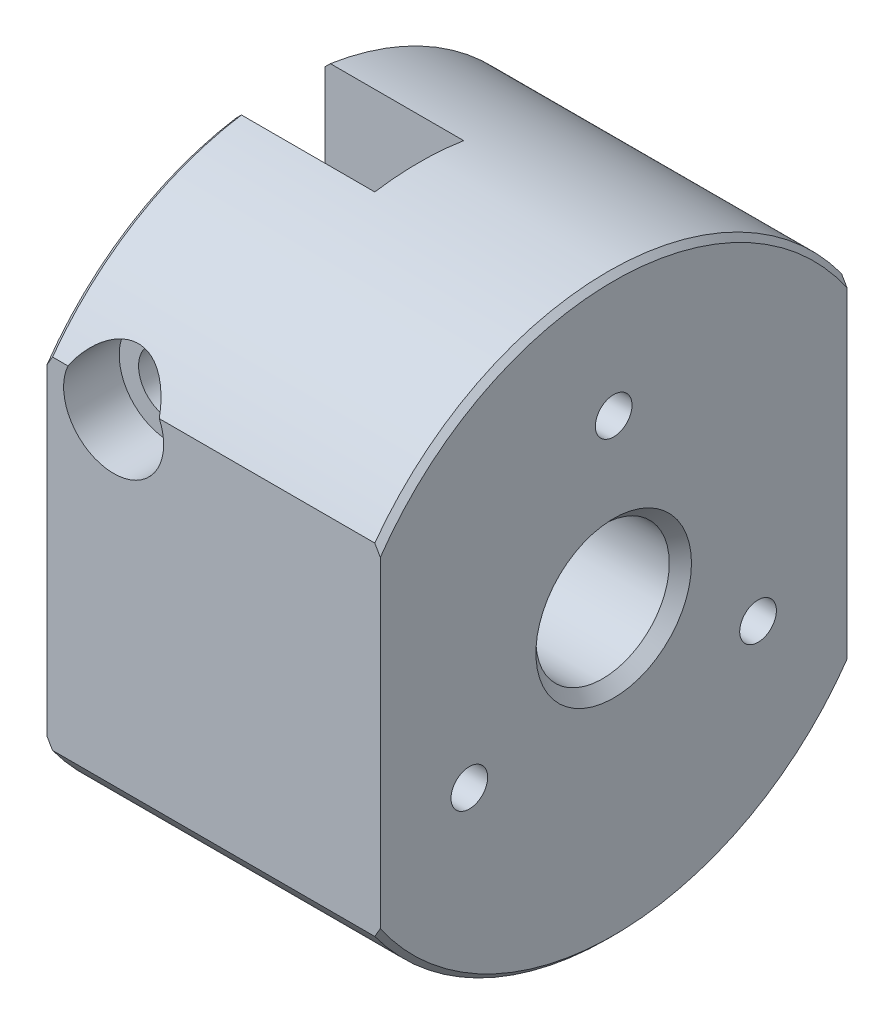
ISO-10303-21;
HEADER;
FILE_DESCRIPTION(('STEP AP214'),'2;1');
FILE_NAME('part.step','',(''),(''),'','','');
FILE_SCHEMA(('AUTOMOTIVE_DESIGN { 1 0 10303 214 1 1 1 1 }'));
ENDSEC;
DATA;
#1=APPLICATION_CONTEXT('core data for automotive mechanical design processes');
#2=APPLICATION_PROTOCOL_DEFINITION('international standard','automotive_design',2000,#1);
#3=PRODUCT_CONTEXT('',#1,'mechanical');
#4=PRODUCT('Part','Part','',(#3));
#5=PRODUCT_RELATED_PRODUCT_CATEGORY('part','',(#4));
#6=PRODUCT_DEFINITION_FORMATION('','',#4);
#7=PRODUCT_DEFINITION_CONTEXT('part definition',#1,'design');
#8=PRODUCT_DEFINITION('design','',#6,#7);
#9=PRODUCT_DEFINITION_SHAPE('','',#8);
#10=(LENGTH_UNIT() NAMED_UNIT(*) SI_UNIT(.MILLI.,.METRE.));
#11=(NAMED_UNIT(*) PLANE_ANGLE_UNIT() SI_UNIT($,.RADIAN.));
#12=(NAMED_UNIT(*) SI_UNIT($,.STERADIAN.) SOLID_ANGLE_UNIT());
#13=UNCERTAINTY_MEASURE_WITH_UNIT(LENGTH_MEASURE(1.E-05),#10,'distance_accuracy_value','');
#14=(GEOMETRIC_REPRESENTATION_CONTEXT(3) GLOBAL_UNCERTAINTY_ASSIGNED_CONTEXT((#13)) GLOBAL_UNIT_ASSIGNED_CONTEXT((#10,
#11,#12)) REPRESENTATION_CONTEXT('',''));
#15=CARTESIAN_POINT('',(0.,0.,0.));
#16=DIRECTION('',(0.,0.,1.));
#17=DIRECTION('',(1.,0.,0.));
#18=AXIS2_PLACEMENT_3D('',#15,#16,#17);
#19=CARTESIAN_POINT('',(-30.,0.,0.));
#20=DIRECTION('',(1.,0.,0.));
#21=DIRECTION('',(0.,0.,-1.));
#22=AXIS2_PLACEMENT_3D('',#19,#20,#21);
#23=CYLINDRICAL_SURFACE('',#22,26.);
#24=DIRECTION('',(1.,0.,0.));
#25=VECTOR('',#24,1.);
#26=CARTESIAN_POINT('',(-30.,-15.3297097167559,-21.));
#27=LINE('',#26,#25);
#28=CARTESIAN_POINT('',(-29.5000000000013,-15.3297097167559,-21.));
#29=VERTEX_POINT('',#28);
#30=CARTESIAN_POINT('',(-0.50000000000127,-15.3297097167559,-21.));
#31=VERTEX_POINT('',#30);
#32=EDGE_CURVE('E237',#29,#31,#27,.T.);
#33=ORIENTED_EDGE('',*,*,#32,.T.);
#34=CARTESIAN_POINT('',(-0.50000000000127,0.,0.));
#35=DIRECTION('',(1.,0.,0.));
#36=DIRECTION('',(0.,0.,-1.));
#37=AXIS2_PLACEMENT_3D('',#34,#35,#36);
#38=CIRCLE('',#37,26.);
#39=CARTESIAN_POINT('',(-0.50000000000127,-15.3297097167559,21.));
#40=VERTEX_POINT('',#39);
#41=EDGE_CURVE('E455',#31,#40,#38,.F.);
#42=ORIENTED_EDGE('',*,*,#41,.T.);
#43=DIRECTION('',(1.,0.,0.));
#44=VECTOR('',#43,1.);
#45=CARTESIAN_POINT('',(-30.,-15.3297097167559,21.));
#46=LINE('',#45,#44);
#47=CARTESIAN_POINT('',(-29.5000000000013,-15.3297097167559,21.));
#48=VERTEX_POINT('',#47);
#49=EDGE_CURVE('E242',#48,#40,#46,.T.);
#50=ORIENTED_EDGE('',*,*,#49,.F.);
#51=CARTESIAN_POINT('',(-29.5000000000013,0.,0.));
#52=DIRECTION('',(1.,0.,0.));
#53=DIRECTION('',(0.,0.,-1.));
#54=AXIS2_PLACEMENT_3D('',#51,#52,#53);
#55=CIRCLE('',#54,26.);
#56=EDGE_CURVE('E449',#48,#29,#55,.T.);
#57=ORIENTED_EDGE('',*,*,#56,.T.);
#58=EDGE_LOOP('',(#33,#42,#50,#57));
#59=FACE_BOUND('',#58,.T.);
#60=ADVANCED_FACE('F35',(#59),#23,.T.);
#61=CARTESIAN_POINT('',(-30.,15.3297097167559,21.));
#62=DIRECTION('',(0.,0.,1.));
#63=DIRECTION('',(1.,0.,0.));
#64=AXIS2_PLACEMENT_3D('',#61,#62,#63);
#65=PLANE('',#64);
#66=DIRECTION('',(0.,-1.,0.));
#67=VECTOR('',#66,1.);
#68=CARTESIAN_POINT('',(0.,15.3297097167559,21.));
#69=LINE('',#68,#67);
#70=CARTESIAN_POINT('',(0.,14.4654761414917,21.));
#71=VERTEX_POINT('',#70);
#72=CARTESIAN_POINT('',(0.,-14.4654761414917,21.));
#73=VERTEX_POINT('',#72);
#74=EDGE_CURVE('E234',#71,#73,#69,.T.);
#75=ORIENTED_EDGE('',*,*,#74,.F.);
#76=CARTESIAN_POINT('',(0.,14.4654761414917,21.));
#77=CARTESIAN_POINT('',(-0.0821285093217325,14.610212151032,21.));
#78=CARTESIAN_POINT('',(-0.164859437828265,14.7545996325799,21.));
#79=CARTESIAN_POINT('',(-0.331526104904609,15.0426774907645,21.));
#80=CARTESIAN_POINT('',(-0.415461843065167,15.186367867638,21.));
#81=CARTESIAN_POINT('',(-0.50000000000127,15.3297097167559,21.));
#82=B_SPLINE_CURVE_WITH_KNOTS('',3,(#76,#77,#78,#79,#80,#81),.UNSPECIFIED.,.F.,.F.,(4,2,4),(0.,
0.499228767434057,0.998457365292191),.UNSPECIFIED.);
#83=CARTESIAN_POINT('',(-0.50000000000127,15.3297097167559,21.));
#84=VERTEX_POINT('',#83);
#85=EDGE_CURVE('E382',#71,#84,#82,.T.);
#86=ORIENTED_EDGE('',*,*,#85,.T.);
#87=DIRECTION('',(1.,0.,0.));
#88=VECTOR('',#87,1.);
#89=CARTESIAN_POINT('',(-30.,15.3297097167559,21.));
#90=LINE('',#89,#88);
#91=CARTESIAN_POINT('',(-19.8887760517811,15.3297097167559,21.));
#92=VERTEX_POINT('',#91);
#93=EDGE_CURVE('E248',#92,#84,#90,.T.);
#94=ORIENTED_EDGE('',*,*,#93,.F.);
#95=CARTESIAN_POINT('',(-24.,13.5,21.));
#96=DIRECTION('',(0.,0.,1.));
#97=DIRECTION('',(1.,0.,0.));
#98=AXIS2_PLACEMENT_3D('',#95,#96,#97);
#99=CIRCLE('',#98,4.49999999999999);
#100=CARTESIAN_POINT('',(-28.1112239482189,15.3297097167559,21.));
#101=VERTEX_POINT('',#100);
#102=EDGE_CURVE('E181',#101,#92,#99,.T.);
#103=ORIENTED_EDGE('',*,*,#102,.F.);
#104=CARTESIAN_POINT('',(-29.5000000000013,15.3297097167559,21.));
#105=VERTEX_POINT('',#104);
#106=EDGE_CURVE('E246',#105,#101,#90,.T.);
#107=ORIENTED_EDGE('',*,*,#106,.F.);
#108=CARTESIAN_POINT('',(-29.5000000000013,15.3297097167559,21.));
#109=CARTESIAN_POINT('',(-29.584538156937,15.1863678676372,21.));
#110=CARTESIAN_POINT('',(-29.6684738950971,15.042677490763,21.));
#111=CARTESIAN_POINT('',(-29.8351405621726,14.7545996325769,21.));
#112=CARTESIAN_POINT('',(-29.9178714906787,14.6102121510282,21.));
#113=CARTESIAN_POINT('',(-30.,14.4654761414872,21.));
#114=B_SPLINE_CURVE_WITH_KNOTS('',3,(#108,#109,#110,#111,#112,#113),.UNSPECIFIED.,.F.,.F.,(4,2,
4),(0.,0.499228597859451,0.998457365294827),.UNSPECIFIED.);
#115=CARTESIAN_POINT('',(-30.,14.4654761414872,21.));
#116=VERTEX_POINT('',#115);
#117=EDGE_CURVE('E362',#105,#116,#114,.T.);
#118=ORIENTED_EDGE('',*,*,#117,.T.);
#119=DIRECTION('',(0.,-1.,0.));
#120=VECTOR('',#119,1.);
#121=CARTESIAN_POINT('',(-30.,15.3297097167559,21.));
#122=LINE('',#121,#120);
#123=CARTESIAN_POINT('',(-30.,-14.4654761414872,21.));
#124=VERTEX_POINT('',#123);
#125=EDGE_CURVE('E233',#116,#124,#122,.T.);
#126=ORIENTED_EDGE('',*,*,#125,.T.);
#127=CARTESIAN_POINT('',(-30.,-14.4654761414872,21.));
#128=CARTESIAN_POINT('',(-29.9178714906787,-14.6102121510282,21.));
#129=CARTESIAN_POINT('',(-29.8351405621726,-14.7545996325768,21.));
#130=CARTESIAN_POINT('',(-29.6684738950971,-15.042677490763,21.));
#131=CARTESIAN_POINT('',(-29.584538156937,-15.1863678676372,21.));
#132=CARTESIAN_POINT('',(-29.5000000000013,-15.3297097167559,21.));
#133=B_SPLINE_CURVE_WITH_KNOTS('',3,(#127,#128,#129,#130,#131,#132),.UNSPECIFIED.,.F.,.F.,(4,2,
4),(0.,0.499228767435384,0.998457365294843),.UNSPECIFIED.);
#134=EDGE_CURVE('E356',#124,#48,#133,.T.);
#135=ORIENTED_EDGE('',*,*,#134,.T.);
#136=ORIENTED_EDGE('',*,*,#49,.T.);
#137=CARTESIAN_POINT('',(-0.50000000000127,-15.3297097167559,21.));
#138=CARTESIAN_POINT('',(-0.415461843065167,-15.186367867638,21.));
#139=CARTESIAN_POINT('',(-0.331526104904609,-15.0426774907645,21.));
#140=CARTESIAN_POINT('',(-0.164859437828265,-14.7545996325799,21.));
#141=CARTESIAN_POINT('',(-0.0821285093217327,-14.610212151032,21.));
#142=CARTESIAN_POINT('',(0.,-14.4654761414917,21.));
#143=B_SPLINE_CURVE_WITH_KNOTS('',3,(#137,#138,#139,#140,#141,#142),.UNSPECIFIED.,.F.,.F.,(4,2,
4),(0.,0.499228597858133,0.99845736529219),.UNSPECIFIED.);
#144=EDGE_CURVE('E378',#40,#73,#143,.T.);
#145=ORIENTED_EDGE('',*,*,#144,.T.);
#146=EDGE_LOOP('',(#75,#86,#94,#103,#107,#118,#126,#135,#136,#145));
#147=FACE_BOUND('',#146,.T.);
#148=ADVANCED_FACE('F369',(#147),#65,.T.);
#149=CARTESIAN_POINT('',(-30.,0.,0.));
#150=DIRECTION('',(1.,0.,0.));
#151=DIRECTION('',(0.,0.,-1.));
#152=AXIS2_PLACEMENT_3D('',#149,#150,#151);
#153=CYLINDRICAL_SURFACE('',#152,26.);
#154=DIRECTION('',(1.,0.,0.));
#155=VECTOR('',#154,1.);
#156=CARTESIAN_POINT('',(-30.,15.3297097167559,-21.));
#157=LINE('',#156,#155);
#158=CARTESIAN_POINT('',(-29.5000000000013,15.3297097167559,-21.));
#159=VERTEX_POINT('',#158);
#160=CARTESIAN_POINT('',(-0.50000000000127,15.3297097167559,-21.));
#161=VERTEX_POINT('',#160);
#162=EDGE_CURVE('E249',#159,#161,#157,.T.);
#163=ORIENTED_EDGE('',*,*,#162,.F.);
#164=CARTESIAN_POINT('',(-29.5000000000013,0.,0.));
#165=DIRECTION('',(1.,0.,0.));
#166=DIRECTION('',(0.,0.,-1.));
#167=AXIS2_PLACEMENT_3D('',#164,#165,#166);
#168=CIRCLE('',#167,26.);
#169=CARTESIAN_POINT('',(-29.5000000000013,25.6904651573303,-4.));
#170=VERTEX_POINT('',#169);
#171=EDGE_CURVE('E432',#159,#170,#168,.T.);
#172=ORIENTED_EDGE('',*,*,#171,.T.);
#173=DIRECTION('',(-1.,0.,0.));
#174=VECTOR('',#173,1.);
#175=CARTESIAN_POINT('',(-17.5,25.6904651573303,-4.));
#176=LINE('',#175,#174);
#177=CARTESIAN_POINT('',(-17.5,25.6904651573303,-4.));
#178=VERTEX_POINT('',#177);
#179=EDGE_CURVE('E215',#178,#170,#176,.T.);
#180=ORIENTED_EDGE('',*,*,#179,.F.);
#181=CARTESIAN_POINT('',(-17.5,0.,0.));
#182=DIRECTION('',(-1.,0.,0.));
#183=DIRECTION('',(0.,0.,1.));
#184=AXIS2_PLACEMENT_3D('',#181,#182,#183);
#185=CIRCLE('',#184,26.);
#186=CARTESIAN_POINT('',(-17.5,25.6904651573303,4.));
#187=VERTEX_POINT('',#186);
#188=EDGE_CURVE('E202',#187,#178,#185,.T.);
#189=ORIENTED_EDGE('',*,*,#188,.F.);
#190=DIRECTION('',(-1.,0.,0.));
#191=VECTOR('',#190,1.);
#192=CARTESIAN_POINT('',(-17.5,25.6904651573303,4.));
#193=LINE('',#192,#191);
#194=CARTESIAN_POINT('',(-29.5000000000013,25.6904651573303,4.));
#195=VERTEX_POINT('',#194);
#196=EDGE_CURVE('E219',#187,#195,#193,.T.);
#197=ORIENTED_EDGE('',*,*,#196,.T.);
#198=CARTESIAN_POINT('',(-29.5000000000013,0.,0.));
#199=DIRECTION('',(1.,0.,0.));
#200=DIRECTION('',(0.,0.,-1.));
#201=AXIS2_PLACEMENT_3D('',#198,#199,#200);
#202=CIRCLE('',#201,26.);
#203=EDGE_CURVE('E261',#195,#105,#202,.T.);
#204=ORIENTED_EDGE('',*,*,#203,.T.);
#205=ORIENTED_EDGE('',*,*,#106,.T.);
#206=CARTESIAN_POINT('',(-19.8887760517811,15.3297097167559,21.));
#207=CARTESIAN_POINT('',(-19.9532813286592,15.4745746570309,20.8942740964762));
#208=CARTESIAN_POINT('',(-20.0254261694329,15.6161314749052,20.7886188610443));
#209=CARTESIAN_POINT('',(-20.1849617027227,15.8918551304662,20.578599794341));
#210=CARTESIAN_POINT('',(-20.2723785353369,16.0260087699643,20.4742385112818));
#211=CARTESIAN_POINT('',(-20.4631443033817,16.2869352073428,20.2673085294681));
#212=CARTESIAN_POINT('',(-20.5666430076095,16.4136213559169,20.1647679713873));
#213=CARTESIAN_POINT('',(-20.788786549744,16.6567726713648,19.9643865039791));
#214=CARTESIAN_POINT('',(-20.9074182263076,16.7732465731746,19.866541611344));
#215=CARTESIAN_POINT('',(-21.20028289446,17.0299646672447,19.6473168740909));
#216=CARTESIAN_POINT('',(-21.3801837239416,17.1659468770962,19.5283801754201));
#217=CARTESIAN_POINT('',(-21.7655644541301,17.4127232171785,19.3086585201997));
#218=CARTESIAN_POINT('',(-21.9709420209252,17.5236133688716,19.20780468351));
#219=CARTESIAN_POINT('',(-22.3628906543782,17.6959646865732,19.0489846963123));
#220=CARTESIAN_POINT('',(-22.5451726997834,17.7628619706411,18.986482536539));
#221=CARTESIAN_POINT('',(-22.8279454371263,17.8457999466622,18.908433448145));
#222=CARTESIAN_POINT('',(-22.9237973253493,17.8705503601745,18.8850288739609));
#223=CARTESIAN_POINT('',(-23.1180785820688,17.9138534358533,18.8439579261665));
#224=CARTESIAN_POINT('',(-23.2165068031169,17.9324088081729,18.8262890434496));
#225=CARTESIAN_POINT('',(-23.4159502605761,17.9630859393738,18.7970209766793));
#226=CARTESIAN_POINT('',(-23.5169784697042,17.9751634524925,18.7854635430666));
#227=CARTESIAN_POINT('',(-23.7201160620901,17.9924435443964,18.7689136575596));
#228=CARTESIAN_POINT('',(-23.8222249482466,17.9976491565233,18.763918309085));
#229=CARTESIAN_POINT('',(-24.0266671922282,18.0010822215535,18.7606248482816));
#230=CARTESIAN_POINT('',(-24.129000547724,17.9993097465307,18.7623266667805));
#231=CARTESIAN_POINT('',(-24.3329760624261,17.9888256336075,18.772378765216));
#232=CARTESIAN_POINT('',(-24.4346182570776,17.9801143543019,18.7807287015804));
#233=CARTESIAN_POINT('',(-24.6263006592893,17.9571421048054,18.8026931965711));
#234=CARTESIAN_POINT('',(-24.7164884694712,17.9435200047515,18.8157008479499));
#235=CARTESIAN_POINT('',(-24.8950662018272,17.911020725709,18.8466398786682));
#236=CARTESIAN_POINT('',(-24.9834555568472,17.8921419157237,18.8645727861408));
#237=CARTESIAN_POINT('',(-25.2451501203616,17.8280257561445,18.9252475552338));
#238=CARTESIAN_POINT('',(-25.4150886046617,17.775295437849,18.9748783056617));
#239=CARTESIAN_POINT('',(-25.7999417568525,17.6310888870417,19.109091228013));
#240=CARTESIAN_POINT('',(-26.0100160392456,17.5325174719245,19.1998254476309));
#241=CARTESIAN_POINT('',(-26.4058758461813,17.3096697008078,19.4009775648239));
#242=CARTESIAN_POINT('',(-26.5916031843722,17.1853335348522,19.5114411780664));
#243=CARTESIAN_POINT('',(-26.9910759880724,16.8742894122375,19.781624490047));
#244=CARTESIAN_POINT('',(-27.1958394422472,16.6801647784828,19.946037617889));
#245=CARTESIAN_POINT('',(-27.5618684438328,16.2640243297973,20.2867898241255));
#246=CARTESIAN_POINT('',(-27.7231521477226,16.042020213858,20.4631238859248));
#247=CARTESIAN_POINT('',(-27.9088515080971,15.7313783457564,20.701048153336));
#248=CARTESIAN_POINT('',(-27.9528196427516,15.6525215629563,20.7607462633906));
#249=CARTESIAN_POINT('',(-28.0357398233787,15.49270675038,20.8802762213263));
#250=CARTESIAN_POINT('',(-28.0747053138483,15.4117550862361,20.9401072516289));
#251=CARTESIAN_POINT('',(-28.1112239482194,15.3297097167561,20.9999999999999));
#252=B_SPLINE_CURVE_WITH_KNOTS('',3,(#206,#207,#208,#209,#210,#211,#212,#213,#214,#215,#216,
#217,#218,#219,#220,#221,#222,#223,#224,#225,#226,#227,#228,#229,#230,#231,#232,#233,#234,#235,
#236,#237,#238,#239,#240,#241,#242,#243,#244,#245,#246,#247,#248,#249,#250,#251),.UNSPECIFIED.,
.F.,.F.,(4,2,2,2,2,2,2,2,2,2,2,2,2,2,2,2,2,2,2,2,2,2,4),(0.,0.571636348271955,1.14426089161489,
1.72257896861474,2.3003974609843,3.06245089386366,3.82153685876168,4.43079722179822,
4.73564599567035,5.04036123165535,5.34713208477928,5.65376748014359,5.9603997084007,
6.26701609104504,6.54310595602405,6.81928157890334,7.37131145041383,8.11478212843407,
8.85999842227631,9.83467883811118,10.8089516096228,11.1335691567255,11.4572951775913),.UNSPECIFIED.);
#253=EDGE_CURVE('E245',#92,#101,#252,.T.);
#254=ORIENTED_EDGE('',*,*,#253,.F.);
#255=ORIENTED_EDGE('',*,*,#93,.T.);
#256=CARTESIAN_POINT('',(-0.50000000000127,0.,0.));
#257=DIRECTION('',(1.,0.,0.));
#258=DIRECTION('',(0.,0.,-1.));
#259=AXIS2_PLACEMENT_3D('',#256,#257,#258);
#260=CIRCLE('',#259,26.);
#261=EDGE_CURVE('E467',#84,#161,#260,.F.);
#262=ORIENTED_EDGE('',*,*,#261,.T.);
#263=EDGE_LOOP('',(#163,#172,#180,#189,#197,#204,#205,#254,#255,#262));
#264=FACE_BOUND('',#263,.T.);
#265=ADVANCED_FACE('F263',(#264),#153,.T.);
#266=CARTESIAN_POINT('',(-30.,-15.3297097167559,-21.));
#267=DIRECTION('',(0.,0.,-1.));
#268=DIRECTION('',(-1.,0.,0.));
#269=AXIS2_PLACEMENT_3D('',#266,#267,#268);
#270=PLANE('',#269);
#271=CARTESIAN_POINT('',(-24.,13.5,-21.));
#272=DIRECTION('',(0.,0.,1.));
#273=DIRECTION('',(1.,0.,0.));
#274=AXIS2_PLACEMENT_3D('',#271,#272,#273);
#275=CIRCLE('',#274,1.62099999999999);
#276=CARTESIAN_POINT('',(-22.379,13.5,-21.));
#277=VERTEX_POINT('',#276);
#278=EDGE_CURVE('E192',#277,#277,#275,.T.);
#279=ORIENTED_EDGE('',*,*,#278,.T.);
#280=EDGE_LOOP('',(#279));
#281=FACE_BOUND('',#280,.T.);
#282=DIRECTION('',(0.,1.,0.));
#283=VECTOR('',#282,1.);
#284=CARTESIAN_POINT('',(-30.,-15.3297097167559,-21.));
#285=LINE('',#284,#283);
#286=CARTESIAN_POINT('',(-30.,-14.4654761414872,-21.));
#287=VERTEX_POINT('',#286);
#288=CARTESIAN_POINT('',(-30.,14.4654761414872,-21.));
#289=VERTEX_POINT('',#288);
#290=EDGE_CURVE('E230',#287,#289,#285,.T.);
#291=ORIENTED_EDGE('',*,*,#290,.T.);
#292=CARTESIAN_POINT('',(-30.,14.4654761414872,-21.));
#293=CARTESIAN_POINT('',(-29.9178714906787,14.6102121510282,-21.));
#294=CARTESIAN_POINT('',(-29.8351405621726,14.7545996325768,-21.));
#295=CARTESIAN_POINT('',(-29.6684738950971,15.042677490763,-21.));
#296=CARTESIAN_POINT('',(-29.584538156937,15.1863678676372,-21.));
#297=CARTESIAN_POINT('',(-29.5000000000013,15.3297097167559,-21.));
#298=B_SPLINE_CURVE_WITH_KNOTS('',3,(#292,#293,#294,#295,#296,#297),.UNSPECIFIED.,.F.,.F.,(4,2,
4),(0.,0.499228767435388,0.99845736529485),.UNSPECIFIED.);
#299=EDGE_CURVE('E415',#289,#159,#298,.T.);
#300=ORIENTED_EDGE('',*,*,#299,.T.);
#301=ORIENTED_EDGE('',*,*,#162,.T.);
#302=CARTESIAN_POINT('',(-0.50000000000127,15.3297097167559,-21.));
#303=CARTESIAN_POINT('',(-0.415461843065167,15.186367867638,-21.));
#304=CARTESIAN_POINT('',(-0.331526104904609,15.0426774907645,-21.));
#305=CARTESIAN_POINT('',(-0.164859437828265,14.7545996325799,-21.));
#306=CARTESIAN_POINT('',(-0.0821285093217327,14.610212151032,-21.));
#307=CARTESIAN_POINT('',(0.,14.4654761414917,-21.));
#308=B_SPLINE_CURVE_WITH_KNOTS('',3,(#302,#303,#304,#305,#306,#307),.UNSPECIFIED.,.F.,.F.,(4,2,
4),(0.,0.499228597858133,0.99845736529219),.UNSPECIFIED.);
#309=CARTESIAN_POINT('',(0.,14.4654761414917,-21.));
#310=VERTEX_POINT('',#309);
#311=EDGE_CURVE('E401',#161,#310,#308,.T.);
#312=ORIENTED_EDGE('',*,*,#311,.T.);
#313=DIRECTION('',(0.,1.,0.));
#314=VECTOR('',#313,1.);
#315=CARTESIAN_POINT('',(0.,-15.3297097167559,-21.));
#316=LINE('',#315,#314);
#317=CARTESIAN_POINT('',(0.,-14.4654761414917,-21.));
#318=VERTEX_POINT('',#317);
#319=EDGE_CURVE('E222',#318,#310,#316,.T.);
#320=ORIENTED_EDGE('',*,*,#319,.F.);
#321=CARTESIAN_POINT('',(0.,-14.4654761414917,-21.));
#322=CARTESIAN_POINT('',(-0.0821285093217321,-14.610212151032,-21.));
#323=CARTESIAN_POINT('',(-0.164859437828264,-14.7545996325799,-21.));
#324=CARTESIAN_POINT('',(-0.331526104904608,-15.0426774907645,-21.));
#325=CARTESIAN_POINT('',(-0.415461843065166,-15.186367867638,-21.));
#326=CARTESIAN_POINT('',(-0.500000000001269,-15.3297097167559,-21.));
#327=B_SPLINE_CURVE_WITH_KNOTS('',3,(#321,#322,#323,#324,#325,#326),.UNSPECIFIED.,.F.,.F.,(4,2,
4),(0.,0.499228767434055,0.998457365292187),.UNSPECIFIED.);
#328=EDGE_CURVE('E396',#318,#31,#327,.T.);
#329=ORIENTED_EDGE('',*,*,#328,.T.);
#330=ORIENTED_EDGE('',*,*,#32,.F.);
#331=CARTESIAN_POINT('',(-29.5000000000013,-15.3297097167559,-21.));
#332=CARTESIAN_POINT('',(-29.584538156937,-15.1863678676372,-21.));
#333=CARTESIAN_POINT('',(-29.6684738950971,-15.042677490763,-21.));
#334=CARTESIAN_POINT('',(-29.8351405621726,-14.7545996325768,-21.));
#335=CARTESIAN_POINT('',(-29.9178714906787,-14.6102121510282,-21.));
#336=CARTESIAN_POINT('',(-30.,-14.4654761414872,-21.));
#337=B_SPLINE_CURVE_WITH_KNOTS('',3,(#331,#332,#333,#334,#335,#336),.UNSPECIFIED.,.F.,.F.,(4,2,
4),(0.,0.499228597859456,0.99845736529484),.UNSPECIFIED.);
#338=EDGE_CURVE('E349',#29,#287,#337,.T.);
#339=ORIENTED_EDGE('',*,*,#338,.T.);
#340=EDGE_LOOP('',(#291,#300,#301,#312,#320,#329,#330,#339));
#341=FACE_BOUND('',#340,.T.);
#342=ADVANCED_FACE('F406',(#281,#341),#270,.T.);
#343=CARTESIAN_POINT('',(-30.,0.,0.));
#344=DIRECTION('',(1.,0.,0.));
#345=DIRECTION('',(0.,0.,-1.));
#346=AXIS2_PLACEMENT_3D('',#343,#344,#345);
#347=PLANE('',#346);
#348=DIRECTION('',(0.,1.,0.));
#349=VECTOR('',#348,1.);
#350=CARTESIAN_POINT('',(-30.,4.47213595499958,4.));
#351=LINE('',#350,#349);
#352=CARTESIAN_POINT('',(-30.,5.74456264653489,4.));
#353=VERTEX_POINT('',#352);
#354=CARTESIAN_POINT('',(-30.,25.1843205189248,4.));
#355=VERTEX_POINT('',#354);
#356=EDGE_CURVE('E206',#353,#355,#351,.T.);
#357=ORIENTED_EDGE('',*,*,#356,.F.);
#358=CARTESIAN_POINT('',(-30.,0.,0.));
#359=DIRECTION('',(1.,0.,0.));
#360=DIRECTION('',(0.,0.,-1.));
#361=AXIS2_PLACEMENT_3D('',#358,#359,#360);
#362=CIRCLE('',#361,6.99999999999743);
#363=CARTESIAN_POINT('',(-30.,5.74456264653489,-4.));
#364=VERTEX_POINT('',#363);
#365=EDGE_CURVE('E481',#353,#364,#362,.T.);
#366=ORIENTED_EDGE('',*,*,#365,.T.);
#367=DIRECTION('',(0.,-1.,0.));
#368=VECTOR('',#367,1.);
#369=CARTESIAN_POINT('',(-30.,25.6904651573303,-4.));
#370=LINE('',#369,#368);
#371=CARTESIAN_POINT('',(-30.,25.1843205189248,-4.));
#372=VERTEX_POINT('',#371);
#373=EDGE_CURVE('E201',#372,#364,#370,.T.);
#374=ORIENTED_EDGE('',*,*,#373,.F.);
#375=CARTESIAN_POINT('',(-30.,0.,0.));
#376=DIRECTION('',(1.,0.,0.));
#377=DIRECTION('',(0.,0.,-1.));
#378=AXIS2_PLACEMENT_3D('',#375,#376,#377);
#379=CIRCLE('',#378,25.4999999999987);
#380=EDGE_CURVE('E436',#372,#289,#379,.F.);
#381=ORIENTED_EDGE('',*,*,#380,.T.);
#382=ORIENTED_EDGE('',*,*,#290,.F.);
#383=CARTESIAN_POINT('',(-30.,0.,0.));
#384=DIRECTION('',(1.,0.,0.));
#385=DIRECTION('',(0.,0.,-1.));
#386=AXIS2_PLACEMENT_3D('',#383,#384,#385);
#387=CIRCLE('',#386,25.4999999999987);
#388=EDGE_CURVE('E431',#287,#124,#387,.F.);
#389=ORIENTED_EDGE('',*,*,#388,.T.);
#390=ORIENTED_EDGE('',*,*,#125,.F.);
#391=CARTESIAN_POINT('',(-30.,0.,0.));
#392=DIRECTION('',(1.,0.,0.));
#393=DIRECTION('',(0.,0.,-1.));
#394=AXIS2_PLACEMENT_3D('',#391,#392,#393);
#395=CIRCLE('',#394,25.4999999999987);
#396=EDGE_CURVE('E434',#116,#355,#395,.F.);
#397=ORIENTED_EDGE('',*,*,#396,.T.);
#398=EDGE_LOOP('',(#357,#366,#374,#381,#382,#389,#390,#397));
#399=FACE_BOUND('',#398,.T.);
#400=ADVANCED_FACE('F410',(#399),#347,.F.);
#401=CARTESIAN_POINT('',(0.,0.,0.));
#402=DIRECTION('',(1.,0.,0.));
#403=DIRECTION('',(0.,0.,-1.));
#404=AXIS2_PLACEMENT_3D('',#401,#402,#403);
#405=PLANE('',#404);
#406=CARTESIAN_POINT('',(0.,15.,0.));
#407=DIRECTION('',(1.,0.,0.));
#408=DIRECTION('',(0.,0.,-1.));
#409=AXIS2_PLACEMENT_3D('',#406,#407,#408);
#410=CIRCLE('',#409,1.64999999999999);
#411=CARTESIAN_POINT('',(0.,15.,-1.64999999999999));
#412=VERTEX_POINT('',#411);
#413=EDGE_CURVE('E165',#412,#412,#410,.T.);
#414=ORIENTED_EDGE('',*,*,#413,.F.);
#415=EDGE_LOOP('',(#414));
#416=FACE_BOUND('',#415,.T.);
#417=CARTESIAN_POINT('',(0.,-7.49999999999945,-12.9903810567675));
#418=DIRECTION('',(1.,0.,0.));
#419=DIRECTION('',(0.,0.,-1.));
#420=AXIS2_PLACEMENT_3D('',#417,#418,#419);
#421=CIRCLE('',#420,1.64999999999999);
#422=CARTESIAN_POINT('',(0.,-7.49999999999945,-14.6403810567675));
#423=VERTEX_POINT('',#422);
#424=EDGE_CURVE('E164',#423,#423,#421,.T.);
#425=ORIENTED_EDGE('',*,*,#424,.F.);
#426=EDGE_LOOP('',(#425));
#427=FACE_BOUND('',#426,.T.);
#428=CARTESIAN_POINT('',(0.,-7.50000000000055,12.9903810567656));
#429=DIRECTION('',(1.,0.,0.));
#430=DIRECTION('',(0.,0.,-1.));
#431=AXIS2_PLACEMENT_3D('',#428,#429,#430);
#432=CIRCLE('',#431,1.64999999999999);
#433=CARTESIAN_POINT('',(0.,-7.50000000000055,11.3403810567656));
#434=VERTEX_POINT('',#433);
#435=EDGE_CURVE('E175',#434,#434,#432,.T.);
#436=ORIENTED_EDGE('',*,*,#435,.F.);
#437=EDGE_LOOP('',(#436));
#438=FACE_BOUND('',#437,.T.);
#439=CARTESIAN_POINT('',(0.,0.,0.));
#440=DIRECTION('',(1.,0.,0.));
#441=DIRECTION('',(0.,0.,-1.));
#442=AXIS2_PLACEMENT_3D('',#439,#440,#441);
#443=CIRCLE('',#442,7.00000000000255);
#444=CARTESIAN_POINT('',(0.,0.,-7.00000000000255));
#445=VERTEX_POINT('',#444);
#446=EDGE_CURVE('E482',#445,#445,#443,.F.);
#447=ORIENTED_EDGE('',*,*,#446,.T.);
#448=EDGE_LOOP('',(#447));
#449=FACE_BOUND('',#448,.T.);
#450=ORIENTED_EDGE('',*,*,#319,.T.);
#451=CARTESIAN_POINT('',(0.,0.,0.));
#452=DIRECTION('',(1.,0.,0.));
#453=DIRECTION('',(0.,0.,-1.));
#454=AXIS2_PLACEMENT_3D('',#451,#452,#453);
#455=CIRCLE('',#454,25.5000000000013);
#456=EDGE_CURVE('E363',#310,#71,#455,.T.);
#457=ORIENTED_EDGE('',*,*,#456,.T.);
#458=ORIENTED_EDGE('',*,*,#74,.T.);
#459=CARTESIAN_POINT('',(0.,0.,0.));
#460=DIRECTION('',(1.,0.,0.));
#461=DIRECTION('',(0.,0.,-1.));
#462=AXIS2_PLACEMENT_3D('',#459,#460,#461);
#463=CIRCLE('',#462,25.5000000000013);
#464=EDGE_CURVE('E419',#73,#318,#463,.T.);
#465=ORIENTED_EDGE('',*,*,#464,.T.);
#466=EDGE_LOOP('',(#450,#457,#458,#465));
#467=FACE_BOUND('',#466,.T.);
#468=ADVANCED_FACE('F309',(#416,#427,#438,#449,#467),#405,.T.);
#469=CARTESIAN_POINT('',(-17.5,4.47213595499958,4.));
#470=DIRECTION('',(0.,0.,1.));
#471=DIRECTION('',(1.,0.,0.));
#472=AXIS2_PLACEMENT_3D('',#469,#470,#471);
#473=PLANE('',#472);
#474=CARTESIAN_POINT('',(-24.,13.5,4.));
#475=DIRECTION('',(0.,0.,1.));
#476=DIRECTION('',(1.,0.,0.));
#477=AXIS2_PLACEMENT_3D('',#474,#475,#476);
#478=CIRCLE('',#477,2.7559);
#479=CARTESIAN_POINT('',(-21.2441,13.5,4.));
#480=VERTEX_POINT('',#479);
#481=EDGE_CURVE('E189',#480,#480,#478,.T.);
#482=ORIENTED_EDGE('',*,*,#481,.T.);
#483=EDGE_LOOP('',(#482));
#484=FACE_BOUND('',#483,.T.);
#485=DIRECTION('',(-1.,0.,0.));
#486=VECTOR('',#485,1.);
#487=CARTESIAN_POINT('',(-17.5,4.47213595499958,4.));
#488=LINE('',#487,#486);
#489=CARTESIAN_POINT('',(-17.5,4.47213595499958,4.));
#490=VERTEX_POINT('',#489);
#491=CARTESIAN_POINT('',(-28.9999999999975,4.47213595499958,4.));
#492=VERTEX_POINT('',#491);
#493=EDGE_CURVE('E223',#490,#492,#488,.T.);
#494=ORIENTED_EDGE('',*,*,#493,.T.);
#495=CARTESIAN_POINT('',(-28.9999999999975,4.47213595499958,4.));
#496=CARTESIAN_POINT('',(-29.0806182952184,4.58028200071524,4.));
#497=CARTESIAN_POINT('',(-29.1620554383338,4.68781295414888,4.));
#498=CARTESIAN_POINT('',(-29.3263419497503,4.90176833564905,4.));
#499=CARTESIAN_POINT('',(-29.4091911268108,5.00819291046517,4.));
#500=CARTESIAN_POINT('',(-29.5760954997779,5.2200849883291,4.));
#501=CARTESIAN_POINT('',(-29.6601506592283,5.32555252015112,4.));
#502=CARTESIAN_POINT('',(-29.8293219519,5.53565696023108,4.));
#503=CARTESIAN_POINT('',(-29.9144382259955,5.64029375511556,4.));
#504=CARTESIAN_POINT('',(-30.,5.74456264653489,4.));
#505=B_SPLINE_CURVE_WITH_KNOTS('',3,(#495,#496,#497,#498,#499,#500,#501,#502,#503,#504),
.UNSPECIFIED.,.F.,.F.,(4,2,2,2,4),(0.,0.404655885196834,0.809257394054762,1.21384669770081,
1.61849029928059),.UNSPECIFIED.);
#506=EDGE_CURVE('E50',#492,#353,#505,.T.);
#507=ORIENTED_EDGE('',*,*,#506,.T.);
#508=ORIENTED_EDGE('',*,*,#356,.T.);
#509=CARTESIAN_POINT('',(-30.,25.1843205189248,4.));
#510=CARTESIAN_POINT('',(-29.9166767927244,25.2686879617912,4.));
#511=CARTESIAN_POINT('',(-29.8333485224187,25.3530504030931,4.));
#512=CARTESIAN_POINT('',(-29.6666818557524,25.5217652825615,4.));
#513=CARTESIAN_POINT('',(-29.583343459392,25.6061177207282,4.));
#514=CARTESIAN_POINT('',(-29.5000000000013,25.6904651573303,4.));
#515=B_SPLINE_CURVE_WITH_KNOTS('',3,(#509,#510,#511,#512,#513,#514),.UNSPECIFIED.,.F.,.F.,(4,2,
4),(0.,0.355732482648178,0.711464965271469),.UNSPECIFIED.);
#516=EDGE_CURVE('E315',#355,#195,#515,.T.);
#517=ORIENTED_EDGE('',*,*,#516,.T.);
#518=ORIENTED_EDGE('',*,*,#196,.F.);
#519=DIRECTION('',(0.,1.,0.));
#520=VECTOR('',#519,1.);
#521=CARTESIAN_POINT('',(-17.5,4.47213595499958,4.));
#522=LINE('',#521,#520);
#523=EDGE_CURVE('E212',#490,#187,#522,.T.);
#524=ORIENTED_EDGE('',*,*,#523,.F.);
#525=EDGE_LOOP('',(#494,#507,#508,#517,#518,#524));
#526=FACE_BOUND('',#525,.T.);
#527=ADVANCED_FACE('F305',(#484,#526),#473,.F.);
#528=CARTESIAN_POINT('',(-17.5,25.6904651573303,-4.));
#529=DIRECTION('',(0.,0.,-1.));
#530=DIRECTION('',(-1.,0.,0.));
#531=AXIS2_PLACEMENT_3D('',#528,#529,#530);
#532=PLANE('',#531);
#533=CARTESIAN_POINT('',(-24.,13.5,-4.));
#534=DIRECTION('',(0.,0.,-1.));
#535=DIRECTION('',(-1.,0.,0.));
#536=AXIS2_PLACEMENT_3D('',#533,#534,#535);
#537=CIRCLE('',#536,2.00000000000097);
#538=CARTESIAN_POINT('',(-26.000000000001,13.5,-4.));
#539=VERTEX_POINT('',#538);
#540=EDGE_CURVE('E11',#539,#539,#537,.T.);
#541=ORIENTED_EDGE('',*,*,#540,.T.);
#542=EDGE_LOOP('',(#541));
#543=FACE_BOUND('',#542,.T.);
#544=ORIENTED_EDGE('',*,*,#373,.T.);
#545=CARTESIAN_POINT('',(-30.,5.74456264653489,-4.));
#546=CARTESIAN_POINT('',(-29.9144382259955,5.64029375511556,-4.));
#547=CARTESIAN_POINT('',(-29.8293219519,5.53565696023108,-4.));
#548=CARTESIAN_POINT('',(-29.6601506592283,5.32555252015112,-4.));
#549=CARTESIAN_POINT('',(-29.5760954997779,5.2200849883291,-4.));
#550=CARTESIAN_POINT('',(-29.4091911268108,5.00819291046517,-4.));
#551=CARTESIAN_POINT('',(-29.3263419497503,4.90176833564905,-4.));
#552=CARTESIAN_POINT('',(-29.1620554383338,4.68781295414888,-4.));
#553=CARTESIAN_POINT('',(-29.0806182952184,4.58028200071524,-4.));
#554=CARTESIAN_POINT('',(-28.9999999999975,4.47213595499958,-4.));
#555=B_SPLINE_CURVE_WITH_KNOTS('',3,(#545,#546,#547,#548,#549,#550,#551,#552,#553,#554),
.UNSPECIFIED.,.F.,.F.,(4,2,2,2,4),(0.,0.404643601579783,0.80923290522583,1.21383441408376,
1.61849029928059),.UNSPECIFIED.);
#556=CARTESIAN_POINT('',(-28.9999999999975,4.47213595499958,-4.));
#557=VERTEX_POINT('',#556);
#558=EDGE_CURVE('E58',#364,#557,#555,.T.);
#559=ORIENTED_EDGE('',*,*,#558,.T.);
#560=DIRECTION('',(-1.,0.,0.));
#561=VECTOR('',#560,1.);
#562=CARTESIAN_POINT('',(-17.5,4.47213595499958,-4.));
#563=LINE('',#562,#561);
#564=CARTESIAN_POINT('',(-17.5,4.47213595499958,-4.));
#565=VERTEX_POINT('',#564);
#566=EDGE_CURVE('E225',#565,#557,#563,.T.);
#567=ORIENTED_EDGE('',*,*,#566,.F.);
#568=DIRECTION('',(0.,-1.,0.));
#569=VECTOR('',#568,1.);
#570=CARTESIAN_POINT('',(-17.5,25.6904651573303,-4.));
#571=LINE('',#570,#569);
#572=EDGE_CURVE('E205',#178,#565,#571,.T.);
#573=ORIENTED_EDGE('',*,*,#572,.F.);
#574=ORIENTED_EDGE('',*,*,#179,.T.);
#575=CARTESIAN_POINT('',(-29.5000000000013,25.6904651573303,-4.));
#576=CARTESIAN_POINT('',(-29.583343459392,25.6061177207282,-4.));
#577=CARTESIAN_POINT('',(-29.6666818557524,25.5217652825615,-4.));
#578=CARTESIAN_POINT('',(-29.8333485224186,25.353050403093,-4.));
#579=CARTESIAN_POINT('',(-29.9166767927244,25.2686879617912,-4.));
#580=CARTESIAN_POINT('',(-30.,25.1843205189248,-4.));
#581=B_SPLINE_CURVE_WITH_KNOTS('',3,(#575,#576,#577,#578,#579,#580),.UNSPECIFIED.,.F.,.F.,(4,2,
4),(0.,0.355732482623299,0.711464965271484),.UNSPECIFIED.);
#582=EDGE_CURVE('E425',#170,#372,#581,.T.);
#583=ORIENTED_EDGE('',*,*,#582,.T.);
#584=EDGE_LOOP('',(#544,#559,#567,#573,#574,#583));
#585=FACE_BOUND('',#584,.T.);
#586=ADVANCED_FACE('F303',(#543,#585),#532,.F.);
#587=CARTESIAN_POINT('',(-17.5,0.,0.));
#588=DIRECTION('',(-1.,0.,0.));
#589=DIRECTION('',(0.,0.,1.));
#590=AXIS2_PLACEMENT_3D('',#587,#588,#589);
#591=PLANE('',#590);
#592=CARTESIAN_POINT('',(-17.5,21.27272472,0.));
#593=DIRECTION('',(-1.,0.,0.));
#594=DIRECTION('',(0.,0.,1.));
#595=AXIS2_PLACEMENT_3D('',#592,#593,#594);
#596=CIRCLE('',#595,2.54);
#597=CARTESIAN_POINT('',(-17.5,21.27272472,2.54));
#598=VERTEX_POINT('',#597);
#599=EDGE_CURVE('E195',#598,#598,#596,.T.);
#600=ORIENTED_EDGE('',*,*,#599,.F.);
#601=EDGE_LOOP('',(#600));
#602=FACE_BOUND('',#601,.T.);
#603=ORIENTED_EDGE('',*,*,#188,.T.);
#604=ORIENTED_EDGE('',*,*,#572,.T.);
#605=CARTESIAN_POINT('',(-17.5,0.,0.));
#606=DIRECTION('',(1.,0.,0.));
#607=DIRECTION('',(0.,0.,-1.));
#608=AXIS2_PLACEMENT_3D('',#605,#606,#607);
#609=CIRCLE('',#608,6.);
#610=EDGE_CURVE('E209',#565,#490,#609,.T.);
#611=ORIENTED_EDGE('',*,*,#610,.T.);
#612=ORIENTED_EDGE('',*,*,#523,.T.);
#613=EDGE_LOOP('',(#603,#604,#611,#612));
#614=FACE_BOUND('',#613,.T.);
#615=ADVANCED_FACE('F299',(#602,#614),#591,.T.);
#616=CARTESIAN_POINT('',(-30.,0.,0.));
#617=DIRECTION('',(1.,0.,0.));
#618=DIRECTION('',(0.,0.,-1.));
#619=AXIS2_PLACEMENT_3D('',#616,#617,#618);
#620=CYLINDRICAL_SURFACE('',#619,6.);
#621=CARTESIAN_POINT('',(-0.99999999999744,0.,0.));
#622=DIRECTION('',(1.,0.,0.));
#623=DIRECTION('',(0.,0.,-1.));
#624=AXIS2_PLACEMENT_3D('',#621,#622,#623);
#625=CIRCLE('',#624,6.);
#626=CARTESIAN_POINT('',(-0.99999999999744,0.,-6.));
#627=VERTEX_POINT('',#626);
#628=EDGE_CURVE('E484',#627,#627,#625,.T.);
#629=ORIENTED_EDGE('',*,*,#628,.T.);
#630=EDGE_LOOP('',(#629));
#631=FACE_BOUND('',#630,.T.);
#632=ORIENTED_EDGE('',*,*,#566,.T.);
#633=CARTESIAN_POINT('',(-28.9999999999975,0.,0.));
#634=DIRECTION('',(1.,0.,0.));
#635=DIRECTION('',(0.,0.,-1.));
#636=AXIS2_PLACEMENT_3D('',#633,#634,#635);
#637=CIRCLE('',#636,6.);
#638=EDGE_CURVE('E456',#557,#492,#637,.F.);
#639=ORIENTED_EDGE('',*,*,#638,.T.);
#640=ORIENTED_EDGE('',*,*,#493,.F.);
#641=ORIENTED_EDGE('',*,*,#610,.F.);
#642=EDGE_LOOP('',(#632,#639,#640,#641));
#643=FACE_BOUND('',#642,.T.);
#644=ADVANCED_FACE('F295',(#631,#643),#620,.F.);
#645=CARTESIAN_POINT('',(-9.0864696837416,21.27272472,0.));
#646=DIRECTION('',(-1.,0.,0.));
#647=DIRECTION('',(0.,0.,1.));
#648=AXIS2_PLACEMENT_3D('',#645,#646,#647);
#649=CONICAL_SURFACE('',#648,2.54,1.0471975512);
#650=CARTESIAN_POINT('',(-7.62000000001147,21.27272472,0.));
#651=VERTEX_POINT('',#650);
#652=VERTEX_LOOP('',#651);
#653=FACE_BOUND('',#652,.T.);
#654=CARTESIAN_POINT('',(-9.0864696837416,21.27272472,0.));
#655=DIRECTION('',(-1.,0.,0.));
#656=DIRECTION('',(0.,0.,1.));
#657=AXIS2_PLACEMENT_3D('',#654,#655,#656);
#658=CIRCLE('',#657,2.54);
#659=CARTESIAN_POINT('',(-9.0864696837416,21.27272472,2.54));
#660=VERTEX_POINT('',#659);
#661=EDGE_CURVE('E198',#660,#660,#658,.T.);
#662=ORIENTED_EDGE('',*,*,#661,.T.);
#663=EDGE_LOOP('',(#662));
#664=FACE_BOUND('',#663,.T.);
#665=ADVANCED_FACE('F291',(#653,#664),#649,.F.);
#666=CARTESIAN_POINT('',(-17.5,21.27272472,0.));
#667=DIRECTION('',(-1.,0.,0.));
#668=DIRECTION('',(0.,0.,1.));
#669=AXIS2_PLACEMENT_3D('',#666,#667,#668);
#670=CYLINDRICAL_SURFACE('',#669,2.54);
#671=ORIENTED_EDGE('',*,*,#661,.F.);
#672=EDGE_LOOP('',(#671));
#673=FACE_BOUND('',#672,.T.);
#674=ORIENTED_EDGE('',*,*,#599,.T.);
#675=EDGE_LOOP('',(#674));
#676=FACE_BOUND('',#675,.T.);
#677=ADVANCED_FACE('F287',(#673,#676),#670,.F.);
#678=CARTESIAN_POINT('',(-24.,13.5,-4.));
#679=DIRECTION('',(0.,0.,1.));
#680=DIRECTION('',(1.,0.,0.));
#681=AXIS2_PLACEMENT_3D('',#678,#679,#680);
#682=CYLINDRICAL_SURFACE('',#681,1.62099999999999);
#683=CARTESIAN_POINT('',(-24.,13.5,-4.37899999999904));
#684=DIRECTION('',(0.,0.,-1.));
#685=DIRECTION('',(-1.,0.,0.));
#686=AXIS2_PLACEMENT_3D('',#683,#684,#685);
#687=CIRCLE('',#686,1.62099999999999);
#688=CARTESIAN_POINT('',(-25.621,13.5,-4.37899999999904));
#689=VERTEX_POINT('',#688);
#690=EDGE_CURVE('E43',#689,#689,#687,.F.);
#691=ORIENTED_EDGE('',*,*,#690,.T.);
#692=EDGE_LOOP('',(#691));
#693=FACE_BOUND('',#692,.T.);
#694=ORIENTED_EDGE('',*,*,#278,.F.);
#695=EDGE_LOOP('',(#694));
#696=FACE_BOUND('',#695,.T.);
#697=ADVANCED_FACE('F283',(#693,#696),#682,.F.);
#698=CARTESIAN_POINT('',(-24.,13.5,21.));
#699=DIRECTION('',(0.,0.,1.));
#700=DIRECTION('',(1.,0.,0.));
#701=AXIS2_PLACEMENT_3D('',#698,#699,#700);
#702=CYLINDRICAL_SURFACE('',#701,2.7559);
#703=ORIENTED_EDGE('',*,*,#481,.F.);
#704=EDGE_LOOP('',(#703));
#705=FACE_BOUND('',#704,.T.);
#706=CARTESIAN_POINT('',(-24.,13.5,16.));
#707=DIRECTION('',(0.,0.,1.));
#708=DIRECTION('',(1.,0.,0.));
#709=AXIS2_PLACEMENT_3D('',#706,#707,#708);
#710=CIRCLE('',#709,2.75590000000001);
#711=CARTESIAN_POINT('',(-21.2441,13.5,16.));
#712=VERTEX_POINT('',#711);
#713=EDGE_CURVE('E186',#712,#712,#710,.T.);
#714=ORIENTED_EDGE('',*,*,#713,.T.);
#715=EDGE_LOOP('',(#714));
#716=FACE_BOUND('',#715,.T.);
#717=ADVANCED_FACE('F279',(#705,#716),#702,.F.);
#718=CARTESIAN_POINT('',(-21.2441,13.5,16.));
#719=DIRECTION('',(0.,0.,-1.));
#720=DIRECTION('',(-1.,0.,0.));
#721=AXIS2_PLACEMENT_3D('',#718,#719,#720);
#722=PLANE('',#721);
#723=ORIENTED_EDGE('',*,*,#713,.F.);
#724=EDGE_LOOP('',(#723));
#725=FACE_BOUND('',#724,.T.);
#726=CARTESIAN_POINT('',(-24.,13.5,16.));
#727=DIRECTION('',(0.,0.,1.));
#728=DIRECTION('',(1.,0.,0.));
#729=AXIS2_PLACEMENT_3D('',#726,#727,#728);
#730=CIRCLE('',#729,4.49999999999999);
#731=CARTESIAN_POINT('',(-19.5,13.5,16.));
#732=VERTEX_POINT('',#731);
#733=EDGE_CURVE('E183',#732,#732,#730,.T.);
#734=ORIENTED_EDGE('',*,*,#733,.T.);
#735=EDGE_LOOP('',(#734));
#736=FACE_BOUND('',#735,.T.);
#737=ADVANCED_FACE('F273',(#725,#736),#722,.F.);
#738=CARTESIAN_POINT('',(-24.,13.5,21.));
#739=DIRECTION('',(0.,0.,1.));
#740=DIRECTION('',(1.,0.,0.));
#741=AXIS2_PLACEMENT_3D('',#738,#739,#740);
#742=CYLINDRICAL_SURFACE('',#741,4.49999999999999);
#743=ORIENTED_EDGE('',*,*,#253,.T.);
#744=ORIENTED_EDGE('',*,*,#102,.T.);
#745=EDGE_LOOP('',(#743,#744));
#746=FACE_BOUND('',#745,.T.);
#747=ORIENTED_EDGE('',*,*,#733,.F.);
#748=EDGE_LOOP('',(#747));
#749=FACE_BOUND('',#748,.T.);
#750=ADVANCED_FACE('F267',(#746,#749),#742,.F.);
#751=CARTESIAN_POINT('',(-29.5000000000013,0.,0.));
#752=DIRECTION('',(1.,0.,0.));
#753=DIRECTION('',(0.,0.,-1.));
#754=AXIS2_PLACEMENT_3D('',#751,#752,#753);
#755=CONICAL_SURFACE('',#754,26.,0.785398163400016);
#756=ORIENTED_EDGE('',*,*,#299,.F.);
#757=ORIENTED_EDGE('',*,*,#380,.F.);
#758=ORIENTED_EDGE('',*,*,#582,.F.);
#759=ORIENTED_EDGE('',*,*,#171,.F.);
#760=EDGE_LOOP('',(#756,#757,#758,#759));
#761=FACE_BOUND('',#760,.T.);
#762=ADVANCED_FACE('F272',(#761),#755,.T.);
#763=CARTESIAN_POINT('',(0.,0.,0.));
#764=DIRECTION('',(-1.,0.,0.));
#765=DIRECTION('',(0.,0.,1.));
#766=AXIS2_PLACEMENT_3D('',#763,#764,#765);
#767=CONICAL_SURFACE('',#766,25.5000000000013,0.785398163394888);
#768=ORIENTED_EDGE('',*,*,#311,.F.);
#769=ORIENTED_EDGE('',*,*,#261,.F.);
#770=ORIENTED_EDGE('',*,*,#85,.F.);
#771=ORIENTED_EDGE('',*,*,#456,.F.);
#772=EDGE_LOOP('',(#768,#769,#770,#771));
#773=FACE_BOUND('',#772,.T.);
#774=ADVANCED_FACE('F391',(#773),#767,.T.);
#775=CARTESIAN_POINT('',(0.,0.,0.));
#776=DIRECTION('',(-1.,0.,0.));
#777=DIRECTION('',(0.,0.,1.));
#778=AXIS2_PLACEMENT_3D('',#775,#776,#777);
#779=CONICAL_SURFACE('',#778,25.5000000000013,0.785398163394888);
#780=ORIENTED_EDGE('',*,*,#144,.F.);
#781=ORIENTED_EDGE('',*,*,#41,.F.);
#782=ORIENTED_EDGE('',*,*,#328,.F.);
#783=ORIENTED_EDGE('',*,*,#464,.F.);
#784=EDGE_LOOP('',(#780,#781,#782,#783));
#785=FACE_BOUND('',#784,.T.);
#786=ADVANCED_FACE('F388',(#785),#779,.T.);
#787=CARTESIAN_POINT('',(-29.5000000000013,0.,0.));
#788=DIRECTION('',(1.,0.,0.));
#789=DIRECTION('',(0.,0.,-1.));
#790=AXIS2_PLACEMENT_3D('',#787,#788,#789);
#791=CONICAL_SURFACE('',#790,26.,0.785398163400019);
#792=ORIENTED_EDGE('',*,*,#516,.F.);
#793=ORIENTED_EDGE('',*,*,#396,.F.);
#794=ORIENTED_EDGE('',*,*,#117,.F.);
#795=ORIENTED_EDGE('',*,*,#203,.F.);
#796=EDGE_LOOP('',(#792,#793,#794,#795));
#797=FACE_BOUND('',#796,.T.);
#798=ADVANCED_FACE('F343',(#797),#791,.T.);
#799=CARTESIAN_POINT('',(-29.5000000000013,0.,0.));
#800=DIRECTION('',(1.,0.,0.));
#801=DIRECTION('',(0.,0.,-1.));
#802=AXIS2_PLACEMENT_3D('',#799,#800,#801);
#803=CONICAL_SURFACE('',#802,26.,0.785398163400012);
#804=ORIENTED_EDGE('',*,*,#134,.F.);
#805=ORIENTED_EDGE('',*,*,#388,.F.);
#806=ORIENTED_EDGE('',*,*,#338,.F.);
#807=ORIENTED_EDGE('',*,*,#56,.F.);
#808=EDGE_LOOP('',(#804,#805,#806,#807));
#809=FACE_BOUND('',#808,.T.);
#810=ADVANCED_FACE('F339',(#809),#803,.T.);
#811=CARTESIAN_POINT('',(-0.99999999999744,0.,0.));
#812=DIRECTION('',(1.,0.,0.));
#813=DIRECTION('',(0.,0.,-1.));
#814=AXIS2_PLACEMENT_3D('',#811,#812,#813);
#815=CONICAL_SURFACE('',#814,6.,0.785398163400004);
#816=ORIENTED_EDGE('',*,*,#446,.F.);
#817=EDGE_LOOP('',(#816));
#818=FACE_BOUND('',#817,.T.);
#819=ORIENTED_EDGE('',*,*,#628,.F.);
#820=EDGE_LOOP('',(#819));
#821=FACE_BOUND('',#820,.T.);
#822=ADVANCED_FACE('F335',(#818,#821),#815,.F.);
#823=CARTESIAN_POINT('',(-30.,0.,0.));
#824=DIRECTION('',(-1.,0.,0.));
#825=DIRECTION('',(0.,0.,1.));
#826=AXIS2_PLACEMENT_3D('',#823,#824,#825);
#827=CONICAL_SURFACE('',#826,6.99999999999743,0.785398163394892);
#828=ORIENTED_EDGE('',*,*,#506,.F.);
#829=ORIENTED_EDGE('',*,*,#638,.F.);
#830=ORIENTED_EDGE('',*,*,#558,.F.);
#831=ORIENTED_EDGE('',*,*,#365,.F.);
#832=EDGE_LOOP('',(#828,#829,#830,#831));
#833=FACE_BOUND('',#832,.T.);
#834=ADVANCED_FACE('F331',(#833),#827,.F.);
#835=CARTESIAN_POINT('',(-24.,13.5,-4.37899999999904));
#836=DIRECTION('',(0.,0.,1.));
#837=DIRECTION('',(1.,0.,0.));
#838=AXIS2_PLACEMENT_3D('',#835,#836,#837);
#839=CONICAL_SURFACE('',#838,1.62099999999999,0.785398163400008);
#840=ORIENTED_EDGE('',*,*,#540,.F.);
#841=EDGE_LOOP('',(#840));
#842=FACE_BOUND('',#841,.T.);
#843=ORIENTED_EDGE('',*,*,#690,.F.);
#844=EDGE_LOOP('',(#843));
#845=FACE_BOUND('',#844,.T.);
#846=ADVANCED_FACE('F37',(#842,#845),#839,.F.);
#847=CARTESIAN_POINT('',(-8.,-7.50000000000055,12.9903810567656));
#848=DIRECTION('',(1.,0.,0.));
#849=DIRECTION('',(0.,0.,-1.));
#850=AXIS2_PLACEMENT_3D('',#847,#848,#849);
#851=CONICAL_SURFACE('',#850,1.65,1.02974425867665);
#852=CARTESIAN_POINT('',(-8.99142002139548,-7.50000000000055,12.9903810567656));
#853=VERTEX_POINT('',#852);
#854=VERTEX_LOOP('',#853);
#855=FACE_BOUND('',#854,.T.);
#856=CARTESIAN_POINT('',(-8.,-7.50000000000055,12.9903810567656));
#857=DIRECTION('',(1.,0.,0.));
#858=DIRECTION('',(0.,0.,-1.));
#859=AXIS2_PLACEMENT_3D('',#856,#857,#858);
#860=CIRCLE('',#859,1.65);
#861=CARTESIAN_POINT('',(-8.,-7.50000000000055,11.3403810567656));
#862=VERTEX_POINT('',#861);
#863=EDGE_CURVE('E178',#862,#862,#860,.T.);
#864=ORIENTED_EDGE('',*,*,#863,.T.);
#865=EDGE_LOOP('',(#864));
#866=FACE_BOUND('',#865,.T.);
#867=ADVANCED_FACE('F275',(#855,#866),#851,.F.);
#868=CARTESIAN_POINT('',(0.,-7.50000000000055,12.9903810567656));
#869=DIRECTION('',(1.,0.,0.));
#870=DIRECTION('',(0.,0.,-1.));
#871=AXIS2_PLACEMENT_3D('',#868,#869,#870);
#872=CYLINDRICAL_SURFACE('',#871,1.64999999999999);
#873=ORIENTED_EDGE('',*,*,#863,.F.);
#874=EDGE_LOOP('',(#873));
#875=FACE_BOUND('',#874,.T.);
#876=ORIENTED_EDGE('',*,*,#435,.T.);
#877=EDGE_LOOP('',(#876));
#878=FACE_BOUND('',#877,.T.);
#879=ADVANCED_FACE('F594',(#875,#878),#872,.F.);
#880=CARTESIAN_POINT('',(-8.,-7.49999999999945,-12.9903810567675));
#881=DIRECTION('',(1.,0.,0.));
#882=DIRECTION('',(0.,0.,-1.));
#883=AXIS2_PLACEMENT_3D('',#880,#881,#882);
#884=CONICAL_SURFACE('',#883,1.65,1.02974425867665);
#885=CARTESIAN_POINT('',(-8.99142002139548,-7.49999999999945,-12.9903810567675));
#886=VERTEX_POINT('',#885);
#887=VERTEX_LOOP('',#886);
#888=FACE_BOUND('',#887,.T.);
#889=CARTESIAN_POINT('',(-8.,-7.49999999999945,-12.9903810567675));
#890=DIRECTION('',(1.,0.,0.));
#891=DIRECTION('',(0.,0.,-1.));
#892=AXIS2_PLACEMENT_3D('',#889,#890,#891);
#893=CIRCLE('',#892,1.65);
#894=CARTESIAN_POINT('',(-8.,-7.49999999999945,-14.6403810567675));
#895=VERTEX_POINT('',#894);
#896=EDGE_CURVE('E168',#895,#895,#893,.T.);
#897=ORIENTED_EDGE('',*,*,#896,.T.);
#898=EDGE_LOOP('',(#897));
#899=FACE_BOUND('',#898,.T.);
#900=ADVANCED_FACE('F604',(#888,#899),#884,.F.);
#901=CARTESIAN_POINT('',(0.,-7.49999999999945,-12.9903810567675));
#902=DIRECTION('',(1.,0.,0.));
#903=DIRECTION('',(0.,0.,-1.));
#904=AXIS2_PLACEMENT_3D('',#901,#902,#903);
#905=CYLINDRICAL_SURFACE('',#904,1.64999999999999);
#906=ORIENTED_EDGE('',*,*,#896,.F.);
#907=EDGE_LOOP('',(#906));
#908=FACE_BOUND('',#907,.T.);
#909=ORIENTED_EDGE('',*,*,#424,.T.);
#910=EDGE_LOOP('',(#909));
#911=FACE_BOUND('',#910,.T.);
#912=ADVANCED_FACE('F158',(#908,#911),#905,.F.);
#913=CARTESIAN_POINT('',(-8.,15.,0.));
#914=DIRECTION('',(1.,0.,0.));
#915=DIRECTION('',(0.,0.,-1.));
#916=AXIS2_PLACEMENT_3D('',#913,#914,#915);
#917=CONICAL_SURFACE('',#916,1.65,1.02974425867665);
#918=CARTESIAN_POINT('',(-8.99142002139548,15.,0.));
#919=VERTEX_POINT('',#918);
#920=VERTEX_LOOP('',#919);
#921=FACE_BOUND('',#920,.T.);
#922=CARTESIAN_POINT('',(-8.,15.,0.));
#923=DIRECTION('',(1.,0.,0.));
#924=DIRECTION('',(0.,0.,-1.));
#925=AXIS2_PLACEMENT_3D('',#922,#923,#924);
#926=CIRCLE('',#925,1.65);
#927=CARTESIAN_POINT('',(-8.,15.,-1.65));
#928=VERTEX_POINT('',#927);
#929=EDGE_CURVE('E162',#928,#928,#926,.T.);
#930=ORIENTED_EDGE('',*,*,#929,.T.);
#931=EDGE_LOOP('',(#930));
#932=FACE_BOUND('',#931,.T.);
#933=ADVANCED_FACE('F154',(#921,#932),#917,.F.);
#934=CARTESIAN_POINT('',(0.,15.,0.));
#935=DIRECTION('',(1.,0.,0.));
#936=DIRECTION('',(0.,0.,-1.));
#937=AXIS2_PLACEMENT_3D('',#934,#935,#936);
#938=CYLINDRICAL_SURFACE('',#937,1.65);
#939=ORIENTED_EDGE('',*,*,#929,.F.);
#940=EDGE_LOOP('',(#939));
#941=FACE_BOUND('',#940,.T.);
#942=ORIENTED_EDGE('',*,*,#413,.T.);
#943=EDGE_LOOP('',(#942));
#944=FACE_BOUND('',#943,.T.);
#945=ADVANCED_FACE('F157',(#941,#944),#938,.F.);
#946=CLOSED_SHELL('',(#60,#148,#265,#342,#400,#468,#527,#586,#615,#644,#665,#677,#697,#717,#737,
#750,#762,#774,#786,#798,#810,#822,#834,#846,#867,#879,#900,#912,#933,#945));
#947=MANIFOLD_SOLID_BREP('B2',#946);
#948=ADVANCED_BREP_SHAPE_REPRESENTATION('',(#18,#947),#14);
#949=SHAPE_DEFINITION_REPRESENTATION(#9,#948);
ENDSEC;
END-ISO-10303-21;
